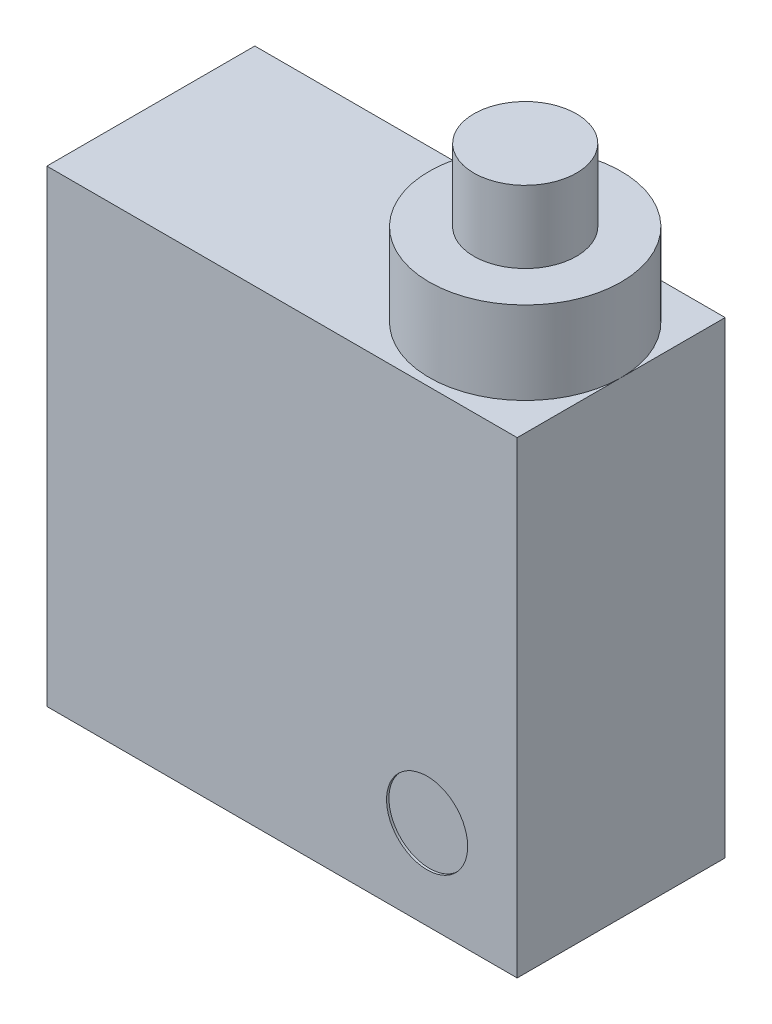
ISO-10303-21;
HEADER;
FILE_DESCRIPTION(('STEP AP214'),'2;1');
FILE_NAME('part.step','',(''),(''),'','','');
FILE_SCHEMA(('AUTOMOTIVE_DESIGN { 1 0 10303 214 1 1 1 1 }'));
ENDSEC;
DATA;
#1=APPLICATION_CONTEXT('core data for automotive mechanical design processes');
#2=APPLICATION_PROTOCOL_DEFINITION('international standard','automotive_design',2000,#1);
#3=PRODUCT_CONTEXT('',#1,'mechanical');
#4=PRODUCT('Part','Part','',(#3));
#5=PRODUCT_RELATED_PRODUCT_CATEGORY('part','',(#4));
#6=PRODUCT_DEFINITION_FORMATION('','',#4);
#7=PRODUCT_DEFINITION_CONTEXT('part definition',#1,'design');
#8=PRODUCT_DEFINITION('design','',#6,#7);
#9=PRODUCT_DEFINITION_SHAPE('','',#8);
#10=(LENGTH_UNIT() NAMED_UNIT(*) SI_UNIT(.MILLI.,.METRE.));
#11=(NAMED_UNIT(*) PLANE_ANGLE_UNIT() SI_UNIT($,.RADIAN.));
#12=(NAMED_UNIT(*) SI_UNIT($,.STERADIAN.) SOLID_ANGLE_UNIT());
#13=UNCERTAINTY_MEASURE_WITH_UNIT(LENGTH_MEASURE(1.E-05),#10,'distance_accuracy_value','');
#14=(GEOMETRIC_REPRESENTATION_CONTEXT(3) GLOBAL_UNCERTAINTY_ASSIGNED_CONTEXT((#13)) GLOBAL_UNIT_ASSIGNED_CONTEXT((#10,
#11,#12)) REPRESENTATION_CONTEXT('',''));
#15=CARTESIAN_POINT('',(0.,0.,0.));
#16=DIRECTION('',(0.,0.,1.));
#17=DIRECTION('',(1.,0.,0.));
#18=AXIS2_PLACEMENT_3D('',#15,#16,#17);
#19=CARTESIAN_POINT('',(0.,19.8,0.));
#20=DIRECTION('',(-1.,0.,0.));
#21=DIRECTION('',(0.,0.,1.));
#22=AXIS2_PLACEMENT_3D('',#19,#20,#21);
#23=PLANE('',#22);
#24=DIRECTION('',(0.,0.,-1.));
#25=VECTOR('',#24,1.);
#26=CARTESIAN_POINT('',(0.,0.,0.));
#27=LINE('',#26,#25);
#28=CARTESIAN_POINT('',(0.,0.,0.));
#29=VERTEX_POINT('',#28);
#30=CARTESIAN_POINT('',(0.,0.,-8.8));
#31=VERTEX_POINT('',#30);
#32=EDGE_CURVE('E117',#29,#31,#27,.T.);
#33=ORIENTED_EDGE('',*,*,#32,.F.);
#34=DIRECTION('',(0.,-1.,0.));
#35=VECTOR('',#34,1.);
#36=CARTESIAN_POINT('',(0.,19.8,0.));
#37=LINE('',#36,#35);
#38=CARTESIAN_POINT('',(0.,19.8,0.));
#39=VERTEX_POINT('',#38);
#40=EDGE_CURVE('E11',#39,#29,#37,.T.);
#41=ORIENTED_EDGE('',*,*,#40,.F.);
#42=DIRECTION('',(0.,0.,-1.));
#43=VECTOR('',#42,1.);
#44=CARTESIAN_POINT('',(0.,19.8,0.));
#45=LINE('',#44,#43);
#46=CARTESIAN_POINT('',(0.,19.8,-8.8));
#47=VERTEX_POINT('',#46);
#48=EDGE_CURVE('E111',#39,#47,#45,.T.);
#49=ORIENTED_EDGE('',*,*,#48,.T.);
#50=DIRECTION('',(0.,-1.,0.));
#51=VECTOR('',#50,1.);
#52=CARTESIAN_POINT('',(0.,19.8,-8.8));
#53=LINE('',#52,#51);
#54=EDGE_CURVE('E85',#47,#31,#53,.T.);
#55=ORIENTED_EDGE('',*,*,#54,.T.);
#56=EDGE_LOOP('',(#33,#41,#49,#55));
#57=FACE_BOUND('',#56,.T.);
#58=ADVANCED_FACE('F42',(#57),#23,.T.);
#59=CARTESIAN_POINT('',(0.,19.8,0.));
#60=DIRECTION('',(0.,0.,-1.));
#61=DIRECTION('',(-1.,0.,0.));
#62=AXIS2_PLACEMENT_3D('',#59,#60,#61);
#63=PLANE('',#62);
#64=CARTESIAN_POINT('',(16.0894266162994,3.77400299379154,0.));
#65=DIRECTION('',(0.,0.,1.));
#66=DIRECTION('',(1.,0.,0.));
#67=AXIS2_PLACEMENT_3D('',#64,#65,#66);
#68=CIRCLE('',#67,1.71602190711462);
#69=CARTESIAN_POINT('',(17.805448523414,3.77400299379154,0.));
#70=VERTEX_POINT('',#69);
#71=EDGE_CURVE('E152',#70,#70,#68,.T.);
#72=ORIENTED_EDGE('',*,*,#71,.F.);
#73=EDGE_LOOP('',(#72));
#74=FACE_BOUND('',#73,.T.);
#75=DIRECTION('',(1.,0.,0.));
#76=VECTOR('',#75,1.);
#77=CARTESIAN_POINT('',(0.,0.,0.));
#78=LINE('',#77,#76);
#79=CARTESIAN_POINT('',(19.9,0.,0.));
#80=VERTEX_POINT('',#79);
#81=EDGE_CURVE('E77',#29,#80,#78,.T.);
#82=ORIENTED_EDGE('',*,*,#81,.T.);
#83=DIRECTION('',(0.,-1.,0.));
#84=VECTOR('',#83,1.);
#85=CARTESIAN_POINT('',(19.9,19.8,0.));
#86=LINE('',#85,#84);
#87=CARTESIAN_POINT('',(19.9,19.8,0.));
#88=VERTEX_POINT('',#87);
#89=EDGE_CURVE('E52',#88,#80,#86,.T.);
#90=ORIENTED_EDGE('',*,*,#89,.F.);
#91=DIRECTION('',(1.,0.,0.));
#92=VECTOR('',#91,1.);
#93=CARTESIAN_POINT('',(0.,19.8,0.));
#94=LINE('',#93,#92);
#95=EDGE_CURVE('E99',#39,#88,#94,.T.);
#96=ORIENTED_EDGE('',*,*,#95,.F.);
#97=ORIENTED_EDGE('',*,*,#40,.T.);
#98=EDGE_LOOP('',(#82,#90,#96,#97));
#99=FACE_BOUND('',#98,.T.);
#100=ADVANCED_FACE('F139',(#74,#99),#63,.F.);
#101=CARTESIAN_POINT('',(19.9,19.8,0.));
#102=DIRECTION('',(-1.,0.,0.));
#103=DIRECTION('',(0.,0.,1.));
#104=AXIS2_PLACEMENT_3D('',#101,#102,#103);
#105=PLANE('',#104);
#106=DIRECTION('',(0.,0.,-1.));
#107=VECTOR('',#106,1.);
#108=CARTESIAN_POINT('',(19.9,0.,0.));
#109=LINE('',#108,#107);
#110=CARTESIAN_POINT('',(19.9,0.,-8.8));
#111=VERTEX_POINT('',#110);
#112=EDGE_CURVE('E126',#80,#111,#109,.T.);
#113=ORIENTED_EDGE('',*,*,#112,.T.);
#114=DIRECTION('',(0.,-1.,0.));
#115=VECTOR('',#114,1.);
#116=CARTESIAN_POINT('',(19.9,19.8,-8.8));
#117=LINE('',#116,#115);
#118=CARTESIAN_POINT('',(19.9,19.8,-8.8));
#119=VERTEX_POINT('',#118);
#120=EDGE_CURVE('E107',#119,#111,#117,.T.);
#121=ORIENTED_EDGE('',*,*,#120,.F.);
#122=DIRECTION('',(0.,0.,-1.));
#123=VECTOR('',#122,1.);
#124=CARTESIAN_POINT('',(19.9,19.8,0.));
#125=LINE('',#124,#123);
#126=CARTESIAN_POINT('',(19.9,19.8,-4.4));
#127=VERTEX_POINT('',#126);
#128=EDGE_CURVE('E102',#127,#119,#125,.T.);
#129=ORIENTED_EDGE('',*,*,#128,.F.);
#130=EDGE_CURVE('E93',#88,#127,#125,.T.);
#131=ORIENTED_EDGE('',*,*,#130,.F.);
#132=ORIENTED_EDGE('',*,*,#89,.T.);
#133=EDGE_LOOP('',(#113,#121,#129,#131,#132));
#134=FACE_BOUND('',#133,.T.);
#135=ADVANCED_FACE('F106',(#134),#105,.F.);
#136=CARTESIAN_POINT('',(0.,19.8,-8.8));
#137=DIRECTION('',(0.,0.,-1.));
#138=DIRECTION('',(-1.,0.,0.));
#139=AXIS2_PLACEMENT_3D('',#136,#137,#138);
#140=PLANE('',#139);
#141=DIRECTION('',(1.,0.,0.));
#142=VECTOR('',#141,1.);
#143=CARTESIAN_POINT('',(0.,0.,-8.8));
#144=LINE('',#143,#142);
#145=EDGE_CURVE('E121',#31,#111,#144,.T.);
#146=ORIENTED_EDGE('',*,*,#145,.F.);
#147=ORIENTED_EDGE('',*,*,#54,.F.);
#148=DIRECTION('',(1.,0.,0.));
#149=VECTOR('',#148,1.);
#150=CARTESIAN_POINT('',(0.,19.8,-8.8));
#151=LINE('',#150,#149);
#152=EDGE_CURVE('E109',#47,#119,#151,.T.);
#153=ORIENTED_EDGE('',*,*,#152,.T.);
#154=ORIENTED_EDGE('',*,*,#120,.T.);
#155=EDGE_LOOP('',(#146,#147,#153,#154));
#156=FACE_BOUND('',#155,.T.);
#157=ADVANCED_FACE('F135',(#156),#140,.T.);
#158=CARTESIAN_POINT('',(0.,19.8,0.));
#159=DIRECTION('',(0.,-1.,0.));
#160=DIRECTION('',(0.,0.,-1.));
#161=AXIS2_PLACEMENT_3D('',#158,#159,#160);
#162=PLANE('',#161);
#163=ORIENTED_EDGE('',*,*,#130,.T.);
#164=CARTESIAN_POINT('',(15.8392809900525,19.8,-4.4));
#165=DIRECTION('',(0.,1.,0.));
#166=DIRECTION('',(0.,0.,1.));
#167=AXIS2_PLACEMENT_3D('',#164,#165,#166);
#168=CIRCLE('',#167,4.06071900994752);
#169=EDGE_CURVE('E97',#127,#127,#168,.T.);
#170=ORIENTED_EDGE('',*,*,#169,.F.);
#171=ORIENTED_EDGE('',*,*,#128,.T.);
#172=ORIENTED_EDGE('',*,*,#152,.F.);
#173=ORIENTED_EDGE('',*,*,#48,.F.);
#174=ORIENTED_EDGE('',*,*,#95,.T.);
#175=EDGE_LOOP('',(#163,#170,#171,#172,#173,#174));
#176=FACE_BOUND('',#175,.T.);
#177=ADVANCED_FACE('F95',(#176),#162,.F.);
#178=CARTESIAN_POINT('',(0.,0.,0.));
#179=DIRECTION('',(0.,-1.,0.));
#180=DIRECTION('',(0.,0.,-1.));
#181=AXIS2_PLACEMENT_3D('',#178,#179,#180);
#182=PLANE('',#181);
#183=ORIENTED_EDGE('',*,*,#32,.T.);
#184=ORIENTED_EDGE('',*,*,#145,.T.);
#185=ORIENTED_EDGE('',*,*,#112,.F.);
#186=ORIENTED_EDGE('',*,*,#81,.F.);
#187=EDGE_LOOP('',(#183,#184,#185,#186));
#188=FACE_BOUND('',#187,.T.);
#189=ADVANCED_FACE('F138',(#188),#182,.T.);
#190=CARTESIAN_POINT('',(15.8392809900525,23.3,-4.4));
#191=DIRECTION('',(0.,-1.,0.));
#192=DIRECTION('',(0.,0.,-1.));
#193=AXIS2_PLACEMENT_3D('',#190,#191,#192);
#194=CYLINDRICAL_SURFACE('',#193,4.06071900994752);
#195=CARTESIAN_POINT('',(15.8392809900525,23.3,-4.4));
#196=DIRECTION('',(0.,1.,0.));
#197=DIRECTION('',(0.,0.,1.));
#198=AXIS2_PLACEMENT_3D('',#195,#196,#197);
#199=CIRCLE('',#198,4.06071900994752);
#200=CARTESIAN_POINT('',(15.8392809900525,23.3,-0.339280990052478));
#201=VERTEX_POINT('',#200);
#202=EDGE_CURVE('E147',#201,#201,#199,.T.);
#203=ORIENTED_EDGE('',*,*,#202,.F.);
#204=EDGE_LOOP('',(#203));
#205=FACE_BOUND('',#204,.T.);
#206=ORIENTED_EDGE('',*,*,#169,.T.);
#207=EDGE_LOOP('',(#206));
#208=FACE_BOUND('',#207,.T.);
#209=ADVANCED_FACE('F187',(#205,#208),#194,.T.);
#210=CARTESIAN_POINT('',(15.8392809900525,23.3,-4.4));
#211=DIRECTION('',(0.,1.,0.));
#212=DIRECTION('',(0.,0.,1.));
#213=AXIS2_PLACEMENT_3D('',#210,#211,#212);
#214=PLANE('',#213);
#215=CARTESIAN_POINT('',(15.8392809900525,23.3,-4.4));
#216=DIRECTION('',(0.,1.,0.));
#217=DIRECTION('',(0.,0.,1.));
#218=AXIS2_PLACEMENT_3D('',#215,#216,#217);
#219=CIRCLE('',#218,2.17209222827026);
#220=CARTESIAN_POINT('',(15.8392809900525,23.3,-2.22790777172974));
#221=VERTEX_POINT('',#220);
#222=EDGE_CURVE('E45',#221,#221,#219,.T.);
#223=ORIENTED_EDGE('',*,*,#222,.F.);
#224=EDGE_LOOP('',(#223));
#225=FACE_BOUND('',#224,.T.);
#226=ORIENTED_EDGE('',*,*,#202,.T.);
#227=EDGE_LOOP('',(#226));
#228=FACE_BOUND('',#227,.T.);
#229=ADVANCED_FACE('F195',(#225,#228),#214,.T.);
#230=CARTESIAN_POINT('',(15.8392809900525,26.35,-4.4));
#231=DIRECTION('',(0.,1.,0.));
#232=DIRECTION('',(0.,0.,1.));
#233=AXIS2_PLACEMENT_3D('',#230,#231,#232);
#234=PLANE('',#233);
#235=CARTESIAN_POINT('',(15.8392809900525,26.35,-4.4));
#236=DIRECTION('',(0.,1.,0.));
#237=DIRECTION('',(0.,0.,1.));
#238=AXIS2_PLACEMENT_3D('',#235,#236,#237);
#239=CIRCLE('',#238,2.17209222827026);
#240=CARTESIAN_POINT('',(15.8392809900525,26.35,-2.22790777172974));
#241=VERTEX_POINT('',#240);
#242=EDGE_CURVE('E122',#241,#241,#239,.T.);
#243=ORIENTED_EDGE('',*,*,#242,.T.);
#244=EDGE_LOOP('',(#243));
#245=FACE_BOUND('',#244,.T.);
#246=ADVANCED_FACE('F191',(#245),#234,.T.);
#247=CARTESIAN_POINT('',(15.8392809900525,26.35,-4.4));
#248=DIRECTION('',(0.,-1.,0.));
#249=DIRECTION('',(0.,0.,-1.));
#250=AXIS2_PLACEMENT_3D('',#247,#248,#249);
#251=CYLINDRICAL_SURFACE('',#250,2.17209222827026);
#252=ORIENTED_EDGE('',*,*,#222,.T.);
#253=EDGE_LOOP('',(#252));
#254=FACE_BOUND('',#253,.T.);
#255=ORIENTED_EDGE('',*,*,#242,.F.);
#256=EDGE_LOOP('',(#255));
#257=FACE_BOUND('',#256,.T.);
#258=ADVANCED_FACE('F165',(#254,#257),#251,.T.);
#259=CARTESIAN_POINT('',(16.0894266162994,3.77400299379154,-0.1));
#260=DIRECTION('',(0.,0.,1.));
#261=DIRECTION('',(1.,0.,0.));
#262=AXIS2_PLACEMENT_3D('',#259,#260,#261);
#263=CYLINDRICAL_SURFACE('',#262,1.71602190711462);
#264=CARTESIAN_POINT('',(16.0894266162994,3.77400299379154,-0.1));
#265=DIRECTION('',(0.,0.,1.));
#266=DIRECTION('',(1.,0.,0.));
#267=AXIS2_PLACEMENT_3D('',#264,#265,#266);
#268=CIRCLE('',#267,1.71602190711462);
#269=CARTESIAN_POINT('',(17.805448523414,3.77400299379154,-0.1));
#270=VERTEX_POINT('',#269);
#271=EDGE_CURVE('E148',#270,#270,#268,.T.);
#272=ORIENTED_EDGE('',*,*,#271,.F.);
#273=EDGE_LOOP('',(#272));
#274=FACE_BOUND('',#273,.T.);
#275=ORIENTED_EDGE('',*,*,#71,.T.);
#276=EDGE_LOOP('',(#275));
#277=FACE_BOUND('',#276,.T.);
#278=ADVANCED_FACE('F162',(#274,#277),#263,.F.);
#279=CARTESIAN_POINT('',(16.0894266162994,3.77400299379154,-0.1));
#280=DIRECTION('',(0.,0.,1.));
#281=DIRECTION('',(1.,0.,0.));
#282=AXIS2_PLACEMENT_3D('',#279,#280,#281);
#283=PLANE('',#282);
#284=ORIENTED_EDGE('',*,*,#271,.T.);
#285=EDGE_LOOP('',(#284));
#286=FACE_BOUND('',#285,.T.);
#287=ADVANCED_FACE('F160',(#286),#283,.T.);
#288=CLOSED_SHELL('',(#58,#100,#135,#157,#177,#189,#209,#229,#246,#258,#278,#287));
#289=MANIFOLD_SOLID_BREP('B2',#288);
#290=ADVANCED_BREP_SHAPE_REPRESENTATION('',(#18,#289),#14);
#291=SHAPE_DEFINITION_REPRESENTATION(#9,#290);
ENDSEC;
END-ISO-10303-21;
